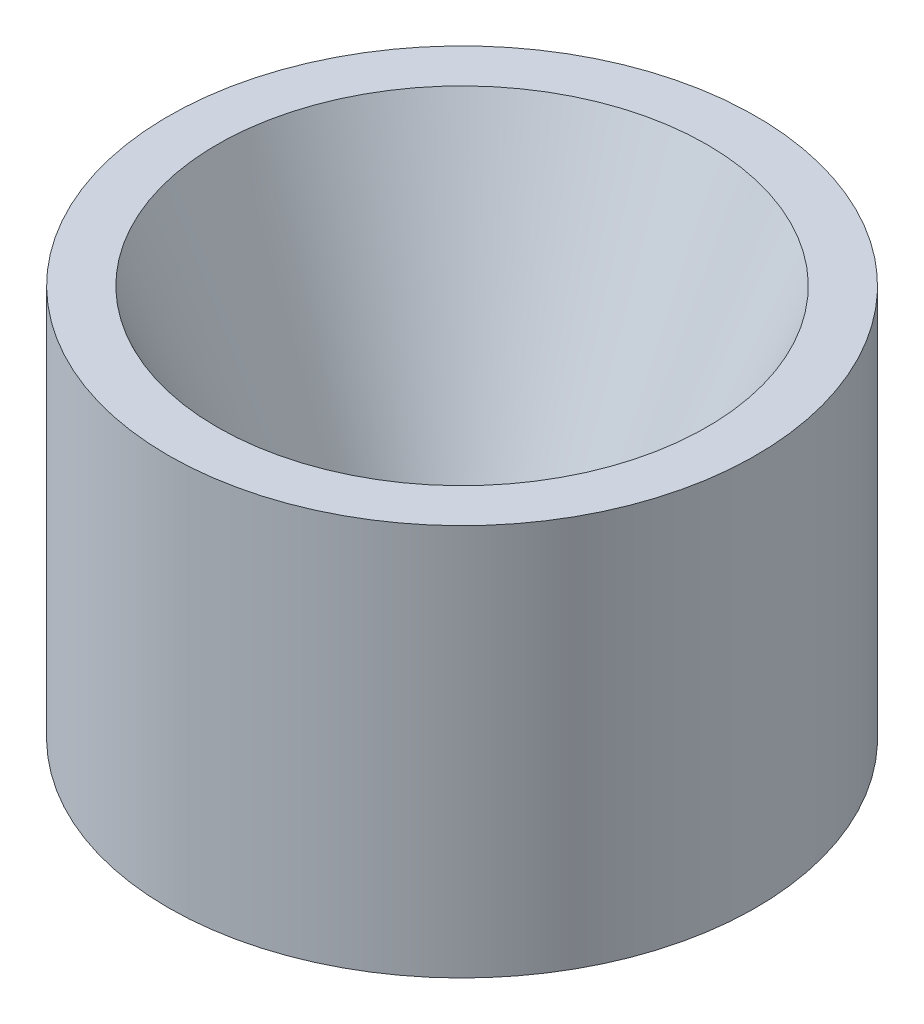
ISO-10303-21;
HEADER;
FILE_DESCRIPTION(('STEP AP214'),'2;1');
FILE_NAME('part.step','',(''),(''),'','','');
FILE_SCHEMA(('AUTOMOTIVE_DESIGN { 1 0 10303 214 1 1 1 1 }'));
ENDSEC;
DATA;
#1=APPLICATION_CONTEXT('core data for automotive mechanical design processes');
#2=APPLICATION_PROTOCOL_DEFINITION('international standard','automotive_design',2000,#1);
#3=PRODUCT_CONTEXT('',#1,'mechanical');
#4=PRODUCT('Part','Part','',(#3));
#5=PRODUCT_RELATED_PRODUCT_CATEGORY('part','',(#4));
#6=PRODUCT_DEFINITION_FORMATION('','',#4);
#7=PRODUCT_DEFINITION_CONTEXT('part definition',#1,'design');
#8=PRODUCT_DEFINITION('design','',#6,#7);
#9=PRODUCT_DEFINITION_SHAPE('','',#8);
#10=(LENGTH_UNIT() NAMED_UNIT(*) SI_UNIT(.MILLI.,.METRE.));
#11=(NAMED_UNIT(*) PLANE_ANGLE_UNIT() SI_UNIT($,.RADIAN.));
#12=(NAMED_UNIT(*) SI_UNIT($,.STERADIAN.) SOLID_ANGLE_UNIT());
#13=UNCERTAINTY_MEASURE_WITH_UNIT(LENGTH_MEASURE(1.E-05),#10,'distance_accuracy_value','');
#14=(GEOMETRIC_REPRESENTATION_CONTEXT(3) GLOBAL_UNCERTAINTY_ASSIGNED_CONTEXT((#13)) GLOBAL_UNIT_ASSIGNED_CONTEXT((#10,
#11,#12)) REPRESENTATION_CONTEXT('',''));
#15=CARTESIAN_POINT('',(0.,0.,0.));
#16=DIRECTION('',(0.,0.,1.));
#17=DIRECTION('',(1.,0.,0.));
#18=AXIS2_PLACEMENT_3D('',#15,#16,#17);
#19=CARTESIAN_POINT('',(0.,6.88636363636364,0.));
#20=DIRECTION('',(0.,1.,0.));
#21=DIRECTION('',(0.,0.,1.));
#22=AXIS2_PLACEMENT_3D('',#19,#20,#21);
#23=CYLINDRICAL_SURFACE('',#22,3.);
#24=CARTESIAN_POINT('',(0.,6.87451636090053,0.));
#25=DIRECTION('',(0.,1.,0.));
#26=DIRECTION('',(0.,0.,1.));
#27=AXIS2_PLACEMENT_3D('',#24,#25,#26);
#28=CIRCLE('',#27,3.);
#29=CARTESIAN_POINT('',(0.,6.87451636090053,3.));
#30=VERTEX_POINT('',#29);
#31=EDGE_CURVE('E10',#30,#30,#28,.T.);
#32=ORIENTED_EDGE('',*,*,#31,.F.);
#33=EDGE_LOOP('',(#32));
#34=FACE_BOUND('',#33,.T.);
#35=CARTESIAN_POINT('',(0.,2.87451636090053,0.));
#36=DIRECTION('',(0.,1.,0.));
#37=DIRECTION('',(0.,0.,1.));
#38=AXIS2_PLACEMENT_3D('',#35,#36,#37);
#39=CIRCLE('',#38,3.);
#40=CARTESIAN_POINT('',(0.,2.87451636090053,3.));
#41=VERTEX_POINT('',#40);
#42=EDGE_CURVE('E52',#41,#41,#39,.T.);
#43=ORIENTED_EDGE('',*,*,#42,.T.);
#44=EDGE_LOOP('',(#43));
#45=FACE_BOUND('',#44,.T.);
#46=ADVANCED_FACE('F30',(#34,#45),#23,.T.);
#47=CARTESIAN_POINT('',(3.,6.87451636090053,0.));
#48=DIRECTION('',(0.,-1.,0.));
#49=DIRECTION('',(0.,0.,-1.));
#50=AXIS2_PLACEMENT_3D('',#47,#48,#49);
#51=PLANE('',#50);
#52=CARTESIAN_POINT('',(0.,6.87451636090053,0.));
#53=DIRECTION('',(0.,1.,0.));
#54=DIRECTION('',(0.,0.,1.));
#55=AXIS2_PLACEMENT_3D('',#52,#53,#54);
#56=CIRCLE('',#55,2.5);
#57=CARTESIAN_POINT('',(0.,6.87451636090053,2.5));
#58=VERTEX_POINT('',#57);
#59=EDGE_CURVE('E36',#58,#58,#56,.T.);
#60=ORIENTED_EDGE('',*,*,#59,.F.);
#61=EDGE_LOOP('',(#60));
#62=FACE_BOUND('',#61,.T.);
#63=ORIENTED_EDGE('',*,*,#31,.T.);
#64=EDGE_LOOP('',(#63));
#65=FACE_BOUND('',#64,.T.);
#66=ADVANCED_FACE('F77',(#62,#65),#51,.F.);
#67=CARTESIAN_POINT('',(0.,6.87451636090053,0.));
#68=DIRECTION('',(0.,1.,0.));
#69=DIRECTION('',(0.,0.,1.));
#70=AXIS2_PLACEMENT_3D('',#67,#68,#69);
#71=CONICAL_SURFACE('',#70,2.5,0.404891786285084);
#72=CARTESIAN_POINT('',(0.,3.37451636090053,0.));
#73=DIRECTION('',(0.,1.,0.));
#74=DIRECTION('',(0.,0.,1.));
#75=AXIS2_PLACEMENT_3D('',#72,#73,#74);
#76=CIRCLE('',#75,1.);
#77=CARTESIAN_POINT('',(0.,3.37451636090053,1.));
#78=VERTEX_POINT('',#77);
#79=EDGE_CURVE('E40',#78,#78,#76,.T.);
#80=ORIENTED_EDGE('',*,*,#79,.F.);
#81=EDGE_LOOP('',(#80));
#82=FACE_BOUND('',#81,.T.);
#83=ORIENTED_EDGE('',*,*,#59,.T.);
#84=EDGE_LOOP('',(#83));
#85=FACE_BOUND('',#84,.T.);
#86=ADVANCED_FACE('F72',(#82,#85),#71,.F.);
#87=CARTESIAN_POINT('',(0.,6.88636363636364,0.));
#88=DIRECTION('',(0.,1.,0.));
#89=DIRECTION('',(0.,0.,1.));
#90=AXIS2_PLACEMENT_3D('',#87,#88,#89);
#91=CYLINDRICAL_SURFACE('',#90,1.);
#92=CARTESIAN_POINT('',(0.,3.28743093704188,0.));
#93=DIRECTION('',(0.,1.,0.));
#94=DIRECTION('',(0.,0.,1.));
#95=AXIS2_PLACEMENT_3D('',#92,#93,#94);
#96=CIRCLE('',#95,1.);
#97=CARTESIAN_POINT('',(0.,3.28743093704188,1.));
#98=VERTEX_POINT('',#97);
#99=EDGE_CURVE('E44',#98,#98,#96,.T.);
#100=ORIENTED_EDGE('',*,*,#99,.F.);
#101=EDGE_LOOP('',(#100));
#102=FACE_BOUND('',#101,.T.);
#103=ORIENTED_EDGE('',*,*,#79,.T.);
#104=EDGE_LOOP('',(#103));
#105=FACE_BOUND('',#104,.T.);
#106=ADVANCED_FACE('F66',(#102,#105),#91,.F.);
#107=CARTESIAN_POINT('',(0.,3.28743093704188,0.));
#108=DIRECTION('',(0.,-1.,0.));
#109=DIRECTION('',(0.,0.,-1.));
#110=AXIS2_PLACEMENT_3D('',#107,#108,#109);
#111=CONICAL_SURFACE('',#110,1.,0.628318530717961);
#112=CARTESIAN_POINT('',(0.,2.87451636090053,0.));
#113=DIRECTION('',(0.,1.,0.));
#114=DIRECTION('',(0.,0.,1.));
#115=AXIS2_PLACEMENT_3D('',#112,#113,#114);
#116=CIRCLE('',#115,1.3);
#117=CARTESIAN_POINT('',(0.,2.87451636090053,1.3));
#118=VERTEX_POINT('',#117);
#119=EDGE_CURVE('E49',#118,#118,#116,.T.);
#120=ORIENTED_EDGE('',*,*,#119,.F.);
#121=EDGE_LOOP('',(#120));
#122=FACE_BOUND('',#121,.T.);
#123=ORIENTED_EDGE('',*,*,#99,.T.);
#124=EDGE_LOOP('',(#123));
#125=FACE_BOUND('',#124,.T.);
#126=ADVANCED_FACE('F60',(#122,#125),#111,.F.);
#127=CARTESIAN_POINT('',(1.3,2.87451636090053,0.));
#128=DIRECTION('',(0.,1.,0.));
#129=DIRECTION('',(0.,0.,1.));
#130=AXIS2_PLACEMENT_3D('',#127,#128,#129);
#131=PLANE('',#130);
#132=ORIENTED_EDGE('',*,*,#42,.F.);
#133=EDGE_LOOP('',(#132));
#134=FACE_BOUND('',#133,.T.);
#135=ORIENTED_EDGE('',*,*,#119,.T.);
#136=EDGE_LOOP('',(#135));
#137=FACE_BOUND('',#136,.T.);
#138=ADVANCED_FACE('F57',(#134,#137),#131,.F.);
#139=CLOSED_SHELL('',(#46,#66,#86,#106,#126,#138));
#140=MANIFOLD_SOLID_BREP('B2',#139);
#141=ADVANCED_BREP_SHAPE_REPRESENTATION('',(#18,#140),#14);
#142=SHAPE_DEFINITION_REPRESENTATION(#9,#141);
ENDSEC;
END-ISO-10303-21;
